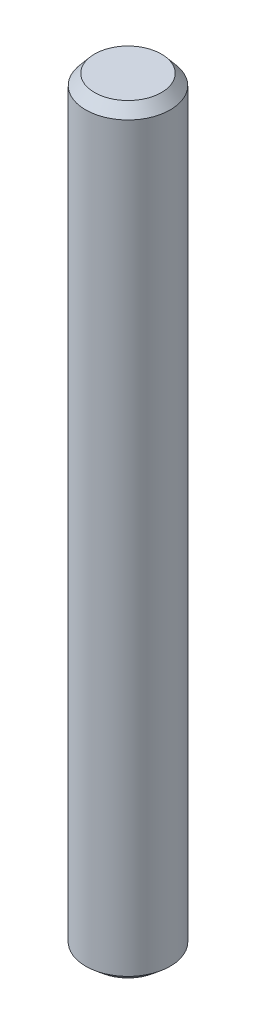
ISO-10303-21;
HEADER;
FILE_DESCRIPTION(('STEP AP214'),'2;1');
FILE_NAME('part.step','',(''),(''),'','','');
FILE_SCHEMA(('AUTOMOTIVE_DESIGN { 1 0 10303 214 1 1 1 1 }'));
ENDSEC;
DATA;
#1=APPLICATION_CONTEXT('core data for automotive mechanical design processes');
#2=APPLICATION_PROTOCOL_DEFINITION('international standard','automotive_design',2000,#1);
#3=PRODUCT_CONTEXT('',#1,'mechanical');
#4=PRODUCT('Part','Part','',(#3));
#5=PRODUCT_RELATED_PRODUCT_CATEGORY('part','',(#4));
#6=PRODUCT_DEFINITION_FORMATION('','',#4);
#7=PRODUCT_DEFINITION_CONTEXT('part definition',#1,'design');
#8=PRODUCT_DEFINITION('design','',#6,#7);
#9=PRODUCT_DEFINITION_SHAPE('','',#8);
#10=(LENGTH_UNIT() NAMED_UNIT(*) SI_UNIT(.MILLI.,.METRE.));
#11=(NAMED_UNIT(*) PLANE_ANGLE_UNIT() SI_UNIT($,.RADIAN.));
#12=(NAMED_UNIT(*) SI_UNIT($,.STERADIAN.) SOLID_ANGLE_UNIT());
#13=UNCERTAINTY_MEASURE_WITH_UNIT(LENGTH_MEASURE(1.E-05),#10,'distance_accuracy_value','');
#14=(GEOMETRIC_REPRESENTATION_CONTEXT(3) GLOBAL_UNCERTAINTY_ASSIGNED_CONTEXT((#13)) GLOBAL_UNIT_ASSIGNED_CONTEXT((#10,
#11,#12)) REPRESENTATION_CONTEXT('',''));
#15=CARTESIAN_POINT('',(0.,0.,0.));
#16=DIRECTION('',(0.,0.,1.));
#17=DIRECTION('',(1.,0.,0.));
#18=AXIS2_PLACEMENT_3D('',#15,#16,#17);
#19=CARTESIAN_POINT('',(0.,72.,0.));
#20=DIRECTION('',(0.,-1.,0.));
#21=DIRECTION('',(0.,0.,-1.));
#22=AXIS2_PLACEMENT_3D('',#19,#20,#21);
#23=CYLINDRICAL_SURFACE('',#22,4.);
#24=CARTESIAN_POINT('',(0.,0.839099631177273,0.));
#25=DIRECTION('',(0.,1.,0.));
#26=DIRECTION('',(0.,0.,1.));
#27=AXIS2_PLACEMENT_3D('',#24,#25,#26);
#28=CIRCLE('',#27,4.);
#29=CARTESIAN_POINT('',(0.,0.839099631177273,4.));
#30=VERTEX_POINT('',#29);
#31=EDGE_CURVE('E47',#30,#30,#28,.T.);
#32=ORIENTED_EDGE('',*,*,#31,.T.);
#33=EDGE_LOOP('',(#32));
#34=FACE_BOUND('',#33,.T.);
#35=CARTESIAN_POINT('',(0.,71.,0.));
#36=DIRECTION('',(0.,1.,0.));
#37=DIRECTION('',(0.,0.,1.));
#38=AXIS2_PLACEMENT_3D('',#35,#36,#37);
#39=CIRCLE('',#38,4.);
#40=CARTESIAN_POINT('',(0.,71.,4.));
#41=VERTEX_POINT('',#40);
#42=EDGE_CURVE('E51',#41,#41,#39,.F.);
#43=ORIENTED_EDGE('',*,*,#42,.T.);
#44=EDGE_LOOP('',(#43));
#45=FACE_BOUND('',#44,.T.);
#46=ADVANCED_FACE('F36',(#34,#45),#23,.T.);
#47=CARTESIAN_POINT('',(0.,72.,0.));
#48=DIRECTION('',(0.,1.,0.));
#49=DIRECTION('',(0.,0.,1.));
#50=AXIS2_PLACEMENT_3D('',#47,#48,#49);
#51=PLANE('',#50);
#52=CARTESIAN_POINT('',(0.,72.,0.));
#53=DIRECTION('',(0.,1.,0.));
#54=DIRECTION('',(0.,0.,1.));
#55=AXIS2_PLACEMENT_3D('',#52,#53,#54);
#56=CIRCLE('',#55,3.16090036882271);
#57=CARTESIAN_POINT('',(0.,72.,3.16090036882271));
#58=VERTEX_POINT('',#57);
#59=EDGE_CURVE('E10',#58,#58,#56,.T.);
#60=ORIENTED_EDGE('',*,*,#59,.T.);
#61=EDGE_LOOP('',(#60));
#62=FACE_BOUND('',#61,.T.);
#63=ADVANCED_FACE('F67',(#62),#51,.T.);
#64=CARTESIAN_POINT('',(0.,0.,0.));
#65=DIRECTION('',(0.,1.,0.));
#66=DIRECTION('',(0.,0.,1.));
#67=AXIS2_PLACEMENT_3D('',#64,#65,#66);
#68=PLANE('',#67);
#69=CARTESIAN_POINT('',(0.,0.,0.));
#70=DIRECTION('',(0.,1.,0.));
#71=DIRECTION('',(0.,0.,1.));
#72=AXIS2_PLACEMENT_3D('',#69,#70,#71);
#73=CIRCLE('',#72,3.00000000000001);
#74=CARTESIAN_POINT('',(0.,0.,3.00000000000001));
#75=VERTEX_POINT('',#74);
#76=EDGE_CURVE('E43',#75,#75,#73,.F.);
#77=ORIENTED_EDGE('',*,*,#76,.T.);
#78=EDGE_LOOP('',(#77));
#79=FACE_BOUND('',#78,.T.);
#80=ADVANCED_FACE('F64',(#79),#68,.F.);
#81=CARTESIAN_POINT('',(0.,0.839099631177273,0.));
#82=DIRECTION('',(0.,1.,0.));
#83=DIRECTION('',(0.,0.,1.));
#84=AXIS2_PLACEMENT_3D('',#81,#82,#83);
#85=CONICAL_SURFACE('',#84,4.,0.872664625997164);
#86=ORIENTED_EDGE('',*,*,#76,.F.);
#87=EDGE_LOOP('',(#86));
#88=FACE_BOUND('',#87,.T.);
#89=ORIENTED_EDGE('',*,*,#31,.F.);
#90=EDGE_LOOP('',(#89));
#91=FACE_BOUND('',#90,.T.);
#92=ADVANCED_FACE('F60',(#88,#91),#85,.T.);
#93=CARTESIAN_POINT('',(0.,72.,0.));
#94=DIRECTION('',(0.,-1.,0.));
#95=DIRECTION('',(0.,0.,-1.));
#96=AXIS2_PLACEMENT_3D('',#93,#94,#95);
#97=CONICAL_SURFACE('',#96,3.16090036882271,0.698131700797731);
#98=ORIENTED_EDGE('',*,*,#42,.F.);
#99=EDGE_LOOP('',(#98));
#100=FACE_BOUND('',#99,.T.);
#101=ORIENTED_EDGE('',*,*,#59,.F.);
#102=EDGE_LOOP('',(#101));
#103=FACE_BOUND('',#102,.T.);
#104=ADVANCED_FACE('F38',(#100,#103),#97,.T.);
#105=CLOSED_SHELL('',(#46,#63,#80,#92,#104));
#106=MANIFOLD_SOLID_BREP('B2',#105);
#107=ADVANCED_BREP_SHAPE_REPRESENTATION('',(#18,#106),#14);
#108=SHAPE_DEFINITION_REPRESENTATION(#9,#107);
ENDSEC;
END-ISO-10303-21;
